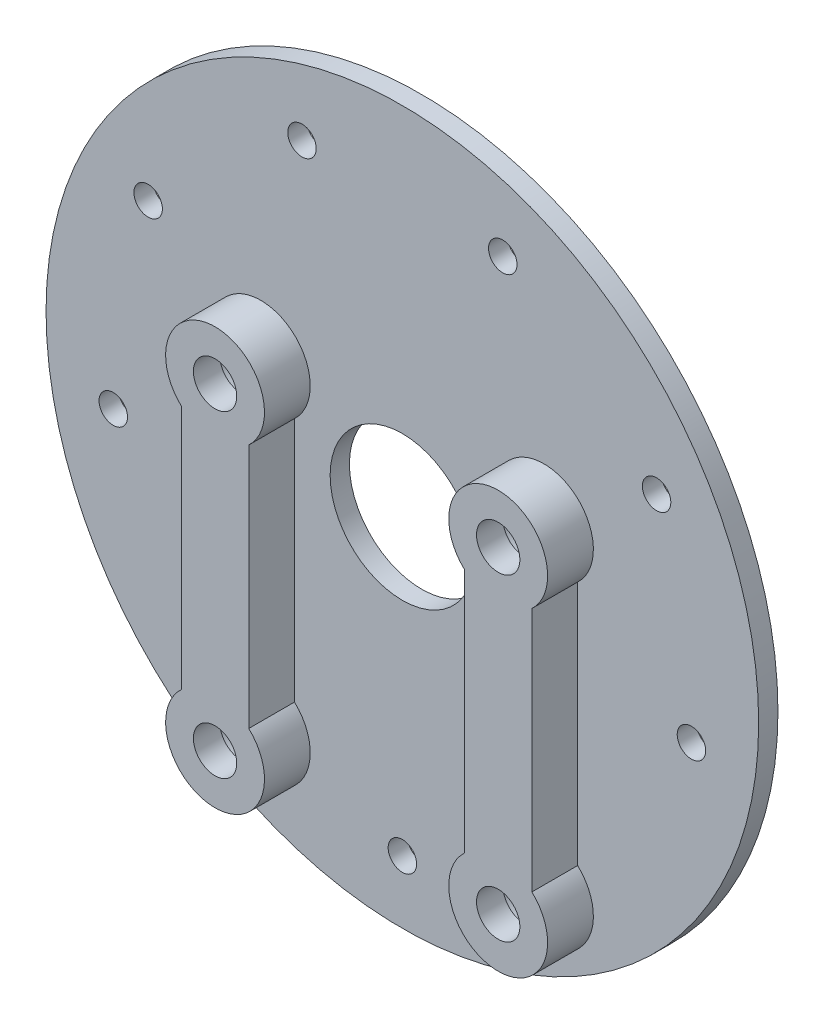
ISO-10303-21;
HEADER;
FILE_DESCRIPTION(('STEP AP214'),'2;1');
FILE_NAME('part.step','',(''),(''),'','','');
FILE_SCHEMA(('AUTOMOTIVE_DESIGN { 1 0 10303 214 1 1 1 1 }'));
ENDSEC;
DATA;
#1=APPLICATION_CONTEXT('core data for automotive mechanical design processes');
#2=APPLICATION_PROTOCOL_DEFINITION('international standard','automotive_design',2000,#1);
#3=PRODUCT_CONTEXT('',#1,'mechanical');
#4=PRODUCT('Part','Part','',(#3));
#5=PRODUCT_RELATED_PRODUCT_CATEGORY('part','',(#4));
#6=PRODUCT_DEFINITION_FORMATION('','',#4);
#7=PRODUCT_DEFINITION_CONTEXT('part definition',#1,'design');
#8=PRODUCT_DEFINITION('design','',#6,#7);
#9=PRODUCT_DEFINITION_SHAPE('','',#8);
#10=(LENGTH_UNIT() NAMED_UNIT(*) SI_UNIT(.MILLI.,.METRE.));
#11=(NAMED_UNIT(*) PLANE_ANGLE_UNIT() SI_UNIT($,.RADIAN.));
#12=(NAMED_UNIT(*) SI_UNIT($,.STERADIAN.) SOLID_ANGLE_UNIT());
#13=UNCERTAINTY_MEASURE_WITH_UNIT(LENGTH_MEASURE(1.E-05),#10,'distance_accuracy_value','');
#14=(GEOMETRIC_REPRESENTATION_CONTEXT(3) GLOBAL_UNCERTAINTY_ASSIGNED_CONTEXT((#13)) GLOBAL_UNIT_ASSIGNED_CONTEXT((#10,
#11,#12)) REPRESENTATION_CONTEXT('',''));
#15=CARTESIAN_POINT('',(0.,0.,0.));
#16=DIRECTION('',(0.,0.,1.));
#17=DIRECTION('',(1.,0.,0.));
#18=AXIS2_PLACEMENT_3D('',#15,#16,#17);
#19=CARTESIAN_POINT('',(0.,0.,2.));
#20=DIRECTION('',(0.,0.,1.));
#21=DIRECTION('',(1.,0.,0.));
#22=AXIS2_PLACEMENT_3D('',#19,#20,#21);
#23=PLANE('',#22);
#24=CARTESIAN_POINT('',(0.,0.,2.));
#25=DIRECTION('',(0.,0.,1.));
#26=DIRECTION('',(1.,0.,0.));
#27=AXIS2_PLACEMENT_3D('',#24,#25,#26);
#28=CIRCLE('',#27,7.49999999999999);
#29=CARTESIAN_POINT('',(7.49999999999999,0.,2.));
#30=VERTEX_POINT('',#29);
#31=EDGE_CURVE('E344',#30,#30,#28,.T.);
#32=ORIENTED_EDGE('',*,*,#31,.F.);
#33=EDGE_LOOP('',(#32));
#34=FACE_BOUND('',#33,.T.);
#35=CARTESIAN_POINT('',(-30.0169403118121,-5.29279645528783,2.));
#36=DIRECTION('',(0.,0.,1.));
#37=DIRECTION('',(1.,0.,0.));
#38=AXIS2_PLACEMENT_3D('',#35,#36,#37);
#39=CIRCLE('',#38,1.47828000000002);
#40=CARTESIAN_POINT('',(-28.5386603118121,-5.29279645528783,2.));
#41=VERTEX_POINT('',#40);
#42=EDGE_CURVE('E347',#41,#41,#39,.T.);
#43=ORIENTED_EDGE('',*,*,#42,.F.);
#44=EDGE_LOOP('',(#43));
#45=FACE_BOUND('',#44,.T.);
#46=CARTESIAN_POINT('',(-26.3964543073496,15.2400000000002,2.));
#47=DIRECTION('',(0.,0.,1.));
#48=DIRECTION('',(1.,0.,0.));
#49=AXIS2_PLACEMENT_3D('',#46,#47,#48);
#50=CIRCLE('',#49,1.47828000000002);
#51=CARTESIAN_POINT('',(-24.9181743073496,15.2400000000002,2.));
#52=VERTEX_POINT('',#51);
#53=EDGE_CURVE('E353',#52,#52,#50,.T.);
#54=ORIENTED_EDGE('',*,*,#53,.F.);
#55=EDGE_LOOP('',(#54));
#56=FACE_BOUND('',#55,.T.);
#57=CARTESIAN_POINT('',(-10.4247739685661,28.6418310815546,2.));
#58=DIRECTION('',(0.,0.,1.));
#59=DIRECTION('',(1.,0.,0.));
#60=AXIS2_PLACEMENT_3D('',#57,#58,#59);
#61=CIRCLE('',#60,1.47828000000002);
#62=CARTESIAN_POINT('',(-8.94649396856608,28.6418310815546,2.));
#63=VERTEX_POINT('',#62);
#64=EDGE_CURVE('E359',#63,#63,#61,.T.);
#65=ORIENTED_EDGE('',*,*,#64,.F.);
#66=EDGE_LOOP('',(#65));
#67=FACE_BOUND('',#66,.T.);
#68=CARTESIAN_POINT('',(10.4247739685667,28.6418310815544,2.));
#69=DIRECTION('',(0.,0.,1.));
#70=DIRECTION('',(1.,0.,0.));
#71=AXIS2_PLACEMENT_3D('',#68,#69,#70);
#72=CIRCLE('',#71,1.47828000000002);
#73=CARTESIAN_POINT('',(11.9030539685667,28.6418310815544,2.));
#74=VERTEX_POINT('',#73);
#75=EDGE_CURVE('E365',#74,#74,#72,.T.);
#76=ORIENTED_EDGE('',*,*,#75,.F.);
#77=EDGE_LOOP('',(#76));
#78=FACE_BOUND('',#77,.T.);
#79=CARTESIAN_POINT('',(26.3964543073499,15.2399999999997,2.));
#80=DIRECTION('',(0.,0.,1.));
#81=DIRECTION('',(1.,0.,0.));
#82=AXIS2_PLACEMENT_3D('',#79,#80,#81);
#83=CIRCLE('',#82,1.47828000000002);
#84=CARTESIAN_POINT('',(27.8747343073499,15.2399999999997,2.));
#85=VERTEX_POINT('',#84);
#86=EDGE_CURVE('E371',#85,#85,#83,.T.);
#87=ORIENTED_EDGE('',*,*,#86,.F.);
#88=EDGE_LOOP('',(#87));
#89=FACE_BOUND('',#88,.T.);
#90=CARTESIAN_POINT('',(30.016940311812,-5.29279645528849,2.));
#91=DIRECTION('',(0.,0.,1.));
#92=DIRECTION('',(1.,0.,0.));
#93=AXIS2_PLACEMENT_3D('',#90,#91,#92);
#94=CIRCLE('',#93,1.47828000000002);
#95=CARTESIAN_POINT('',(31.495220311812,-5.29279645528849,2.));
#96=VERTEX_POINT('',#95);
#97=EDGE_CURVE('E377',#96,#96,#94,.T.);
#98=ORIENTED_EDGE('',*,*,#97,.F.);
#99=EDGE_LOOP('',(#98));
#100=FACE_BOUND('',#99,.T.);
#101=CARTESIAN_POINT('',(0.,-30.48,2.));
#102=DIRECTION('',(0.,0.,1.));
#103=DIRECTION('',(1.,0.,0.));
#104=AXIS2_PLACEMENT_3D('',#101,#102,#103);
#105=CIRCLE('',#104,1.47828000000002);
#106=CARTESIAN_POINT('',(1.47828000000002,-30.48,2.));
#107=VERTEX_POINT('',#106);
#108=EDGE_CURVE('E383',#107,#107,#105,.T.);
#109=ORIENTED_EDGE('',*,*,#108,.F.);
#110=EDGE_LOOP('',(#109));
#111=FACE_BOUND('',#110,.T.);
#112=DIRECTION('',(0.,1.,0.));
#113=VECTOR('',#112,1.);
#114=CARTESIAN_POINT('',(-11.2000000001251,3.24641800820938,2.));
#115=LINE('',#114,#113);
#116=CARTESIAN_POINT('',(-11.2000000001251,-22.246481648177,2.));
#117=VERTEX_POINT('',#116);
#118=CARTESIAN_POINT('',(-11.2000000001251,3.24641800820938,2.));
#119=VERTEX_POINT('',#118);
#120=EDGE_CURVE('E126',#117,#119,#115,.T.);
#121=ORIENTED_EDGE('',*,*,#120,.F.);
#122=CARTESIAN_POINT('',(-14.7000000001501,-26.0000212132181,2.));
#123=DIRECTION('',(0.,0.,1.));
#124=DIRECTION('',(-1.,0.,0.));
#125=AXIS2_PLACEMENT_3D('',#122,#123,#124);
#126=CIRCLE('',#125,5.1321593181139);
#127=CARTESIAN_POINT('',(-18.1999999999444,-22.2464816479619,2.));
#128=VERTEX_POINT('',#127);
#129=EDGE_CURVE('E123',#128,#117,#126,.T.);
#130=ORIENTED_EDGE('',*,*,#129,.F.);
#131=DIRECTION('',(0.,-1.,0.));
#132=VECTOR('',#131,1.);
#133=CARTESIAN_POINT('',(-18.1999999999444,-22.2464816479619,2.));
#134=LINE('',#133,#132);
#135=CARTESIAN_POINT('',(-18.1999999999444,3.24641800823799,2.));
#136=VERTEX_POINT('',#135);
#137=EDGE_CURVE('E135',#136,#128,#134,.T.);
#138=ORIENTED_EDGE('',*,*,#137,.F.);
#139=CARTESIAN_POINT('',(-14.7000000000194,6.99995757357735,2.));
#140=DIRECTION('',(0.,0.,1.));
#141=DIRECTION('',(-1.,0.,0.));
#142=AXIS2_PLACEMENT_3D('',#139,#140,#141);
#143=CIRCLE('',#142,5.13215931826389);
#144=EDGE_CURVE('E143',#119,#136,#143,.T.);
#145=ORIENTED_EDGE('',*,*,#144,.F.);
#146=EDGE_LOOP('',(#121,#130,#138,#145));
#147=FACE_BOUND('',#146,.T.);
#148=CARTESIAN_POINT('',(0.,0.,2.));
#149=DIRECTION('',(0.,0.,1.));
#150=DIRECTION('',(1.,0.,0.));
#151=AXIS2_PLACEMENT_3D('',#148,#149,#150);
#152=CIRCLE('',#151,37.);
#153=CARTESIAN_POINT('',(37.,0.,2.));
#154=VERTEX_POINT('',#153);
#155=EDGE_CURVE('E40',#154,#154,#152,.T.);
#156=ORIENTED_EDGE('',*,*,#155,.T.);
#157=EDGE_LOOP('',(#156));
#158=FACE_BOUND('',#157,.T.);
#159=DIRECTION('',(0.,-1.,0.));
#160=VECTOR('',#159,1.);
#161=CARTESIAN_POINT('',(11.2000000000556,-22.2464816477019,2.));
#162=LINE('',#161,#160);
#163=CARTESIAN_POINT('',(11.2000000000556,3.24641800838311,2.));
#164=VERTEX_POINT('',#163);
#165=CARTESIAN_POINT('',(11.2000000000556,-22.2464816477019,2.));
#166=VERTEX_POINT('',#165);
#167=EDGE_CURVE('E393',#164,#166,#162,.T.);
#168=ORIENTED_EDGE('',*,*,#167,.F.);
#169=CARTESIAN_POINT('',(14.6999999999806,6.99995757360497,2.));
#170=DIRECTION('',(0.,0.,1.));
#171=DIRECTION('',(-1.,0.,0.));
#172=AXIS2_PLACEMENT_3D('',#169,#170,#171);
#173=CIRCLE('',#172,5.13215931817796);
#174=CARTESIAN_POINT('',(18.1999999998749,3.2464180083545,2.));
#175=VERTEX_POINT('',#174);
#176=EDGE_CURVE('E121',#175,#164,#173,.T.);
#177=ORIENTED_EDGE('',*,*,#176,.F.);
#178=DIRECTION('',(0.,1.,0.));
#179=VECTOR('',#178,1.);
#180=CARTESIAN_POINT('',(18.1999999998749,3.2464180083545,2.));
#181=LINE('',#180,#179);
#182=CARTESIAN_POINT('',(18.1999999998749,-22.246481647917,2.));
#183=VERTEX_POINT('',#182);
#184=EDGE_CURVE('E117',#183,#175,#181,.T.);
#185=ORIENTED_EDGE('',*,*,#184,.F.);
#186=CARTESIAN_POINT('',(14.6999999998499,-26.0000212131908,2.));
#187=DIRECTION('',(0.,0.,1.));
#188=DIRECTION('',(-1.,0.,0.));
#189=AXIS2_PLACEMENT_3D('',#186,#187,#188);
#190=CIRCLE('',#189,5.13215931828412);
#191=EDGE_CURVE('E395',#166,#183,#190,.T.);
#192=ORIENTED_EDGE('',*,*,#191,.F.);
#193=EDGE_LOOP('',(#168,#177,#185,#192));
#194=FACE_BOUND('',#193,.T.);
#195=ADVANCED_FACE('F32',(#34,#45,#56,#67,#78,#89,#100,#111,#147,#158,#194),#23,.T.);
#196=CARTESIAN_POINT('',(0.,0.,0.));
#197=DIRECTION('',(0.,0.,1.));
#198=DIRECTION('',(1.,0.,0.));
#199=AXIS2_PLACEMENT_3D('',#196,#197,#198);
#200=CYLINDRICAL_SURFACE('',#199,37.);
#201=CARTESIAN_POINT('',(0.,0.,0.));
#202=DIRECTION('',(0.,0.,1.));
#203=DIRECTION('',(1.,0.,0.));
#204=AXIS2_PLACEMENT_3D('',#201,#202,#203);
#205=CIRCLE('',#204,37.);
#206=CARTESIAN_POINT('',(37.,0.,0.));
#207=VERTEX_POINT('',#206);
#208=EDGE_CURVE('E11',#207,#207,#205,.T.);
#209=ORIENTED_EDGE('',*,*,#208,.T.);
#210=EDGE_LOOP('',(#209));
#211=FACE_BOUND('',#210,.T.);
#212=ORIENTED_EDGE('',*,*,#155,.F.);
#213=EDGE_LOOP('',(#212));
#214=FACE_BOUND('',#213,.T.);
#215=ADVANCED_FACE('F34',(#211,#214),#200,.T.);
#216=CARTESIAN_POINT('',(37.,0.,0.));
#217=DIRECTION('',(0.,0.,-1.));
#218=DIRECTION('',(-1.,0.,0.));
#219=AXIS2_PLACEMENT_3D('',#216,#217,#218);
#220=PLANE('',#219);
#221=CARTESIAN_POINT('',(-14.7000000000501,-26.0000000000137,0.));
#222=DIRECTION('',(0.,0.,-1.));
#223=DIRECTION('',(-1.,0.,0.));
#224=AXIS2_PLACEMENT_3D('',#221,#222,#223);
#225=CIRCLE('',#224,3.5);
#226=CARTESIAN_POINT('',(-18.2000000000501,-26.0000000000137,0.));
#227=VERTEX_POINT('',#226);
#228=EDGE_CURVE('E295',#227,#227,#225,.T.);
#229=ORIENTED_EDGE('',*,*,#228,.F.);
#230=EDGE_LOOP('',(#229));
#231=FACE_BOUND('',#230,.T.);
#232=CARTESIAN_POINT('',(14.6999999999999,6.999957573605,0.));
#233=DIRECTION('',(0.,0.,-1.));
#234=DIRECTION('',(-1.,0.,0.));
#235=AXIS2_PLACEMENT_3D('',#232,#233,#234);
#236=CIRCLE('',#235,3.5);
#237=CARTESIAN_POINT('',(11.1999999999999,6.999957573605,0.));
#238=VERTEX_POINT('',#237);
#239=EDGE_CURVE('E305',#238,#238,#236,.T.);
#240=ORIENTED_EDGE('',*,*,#239,.F.);
#241=EDGE_LOOP('',(#240));
#242=FACE_BOUND('',#241,.T.);
#243=CARTESIAN_POINT('',(14.6999999999499,-25.9999999999864,0.));
#244=DIRECTION('',(0.,0.,-1.));
#245=DIRECTION('',(-1.,0.,0.));
#246=AXIS2_PLACEMENT_3D('',#243,#244,#245);
#247=CIRCLE('',#246,3.5);
#248=CARTESIAN_POINT('',(11.1999999999499,-25.9999999999864,0.));
#249=VERTEX_POINT('',#248);
#250=EDGE_CURVE('E317',#249,#249,#247,.T.);
#251=ORIENTED_EDGE('',*,*,#250,.F.);
#252=EDGE_LOOP('',(#251));
#253=FACE_BOUND('',#252,.T.);
#254=CARTESIAN_POINT('',(-14.7000000000001,6.99995757357738,0.));
#255=DIRECTION('',(0.,0.,-1.));
#256=DIRECTION('',(-1.,0.,0.));
#257=AXIS2_PLACEMENT_3D('',#254,#255,#256);
#258=CIRCLE('',#257,3.5);
#259=CARTESIAN_POINT('',(-18.2000000000001,6.99995757357738,0.));
#260=VERTEX_POINT('',#259);
#261=EDGE_CURVE('E329',#260,#260,#258,.T.);
#262=ORIENTED_EDGE('',*,*,#261,.F.);
#263=EDGE_LOOP('',(#262));
#264=FACE_BOUND('',#263,.T.);
#265=CARTESIAN_POINT('',(0.,0.,0.));
#266=DIRECTION('',(0.,0.,-1.));
#267=DIRECTION('',(-1.,0.,0.));
#268=AXIS2_PLACEMENT_3D('',#265,#266,#267);
#269=CIRCLE('',#268,7.49999999999999);
#270=CARTESIAN_POINT('',(-7.49999999999999,0.,0.));
#271=VERTEX_POINT('',#270);
#272=EDGE_CURVE('E341',#271,#271,#269,.T.);
#273=ORIENTED_EDGE('',*,*,#272,.F.);
#274=EDGE_LOOP('',(#273));
#275=FACE_BOUND('',#274,.T.);
#276=CARTESIAN_POINT('',(-30.0169403118121,-5.29279645528783,0.));
#277=DIRECTION('',(0.,0.,1.));
#278=DIRECTION('',(1.,0.,0.));
#279=AXIS2_PLACEMENT_3D('',#276,#277,#278);
#280=CIRCLE('',#279,1.47828000000002);
#281=CARTESIAN_POINT('',(-28.5386603118121,-5.29279645528783,0.));
#282=VERTEX_POINT('',#281);
#283=EDGE_CURVE('E350',#282,#282,#280,.T.);
#284=ORIENTED_EDGE('',*,*,#283,.T.);
#285=EDGE_LOOP('',(#284));
#286=FACE_BOUND('',#285,.T.);
#287=CARTESIAN_POINT('',(-26.3964543073496,15.2400000000002,0.));
#288=DIRECTION('',(0.,0.,1.));
#289=DIRECTION('',(1.,0.,0.));
#290=AXIS2_PLACEMENT_3D('',#287,#288,#289);
#291=CIRCLE('',#290,1.47828000000002);
#292=CARTESIAN_POINT('',(-24.9181743073496,15.2400000000002,0.));
#293=VERTEX_POINT('',#292);
#294=EDGE_CURVE('E356',#293,#293,#291,.T.);
#295=ORIENTED_EDGE('',*,*,#294,.T.);
#296=EDGE_LOOP('',(#295));
#297=FACE_BOUND('',#296,.T.);
#298=CARTESIAN_POINT('',(-10.4247739685661,28.6418310815546,0.));
#299=DIRECTION('',(0.,0.,1.));
#300=DIRECTION('',(1.,0.,0.));
#301=AXIS2_PLACEMENT_3D('',#298,#299,#300);
#302=CIRCLE('',#301,1.47828000000002);
#303=CARTESIAN_POINT('',(-8.94649396856608,28.6418310815546,0.));
#304=VERTEX_POINT('',#303);
#305=EDGE_CURVE('E362',#304,#304,#302,.T.);
#306=ORIENTED_EDGE('',*,*,#305,.T.);
#307=EDGE_LOOP('',(#306));
#308=FACE_BOUND('',#307,.T.);
#309=CARTESIAN_POINT('',(10.4247739685667,28.6418310815544,0.));
#310=DIRECTION('',(0.,0.,1.));
#311=DIRECTION('',(1.,0.,0.));
#312=AXIS2_PLACEMENT_3D('',#309,#310,#311);
#313=CIRCLE('',#312,1.47828000000002);
#314=CARTESIAN_POINT('',(11.9030539685667,28.6418310815544,0.));
#315=VERTEX_POINT('',#314);
#316=EDGE_CURVE('E368',#315,#315,#313,.T.);
#317=ORIENTED_EDGE('',*,*,#316,.T.);
#318=EDGE_LOOP('',(#317));
#319=FACE_BOUND('',#318,.T.);
#320=CARTESIAN_POINT('',(26.3964543073499,15.2399999999997,0.));
#321=DIRECTION('',(0.,0.,1.));
#322=DIRECTION('',(1.,0.,0.));
#323=AXIS2_PLACEMENT_3D('',#320,#321,#322);
#324=CIRCLE('',#323,1.47828000000002);
#325=CARTESIAN_POINT('',(27.8747343073499,15.2399999999997,0.));
#326=VERTEX_POINT('',#325);
#327=EDGE_CURVE('E374',#326,#326,#324,.T.);
#328=ORIENTED_EDGE('',*,*,#327,.T.);
#329=EDGE_LOOP('',(#328));
#330=FACE_BOUND('',#329,.T.);
#331=CARTESIAN_POINT('',(30.016940311812,-5.29279645528849,0.));
#332=DIRECTION('',(0.,0.,1.));
#333=DIRECTION('',(1.,0.,0.));
#334=AXIS2_PLACEMENT_3D('',#331,#332,#333);
#335=CIRCLE('',#334,1.47828000000001);
#336=CARTESIAN_POINT('',(31.495220311812,-5.29279645528849,0.));
#337=VERTEX_POINT('',#336);
#338=EDGE_CURVE('E380',#337,#337,#335,.T.);
#339=ORIENTED_EDGE('',*,*,#338,.T.);
#340=EDGE_LOOP('',(#339));
#341=FACE_BOUND('',#340,.T.);
#342=CARTESIAN_POINT('',(0.,-30.48,0.));
#343=DIRECTION('',(0.,0.,1.));
#344=DIRECTION('',(1.,0.,0.));
#345=AXIS2_PLACEMENT_3D('',#342,#343,#344);
#346=CIRCLE('',#345,1.47828000000002);
#347=CARTESIAN_POINT('',(1.47828000000002,-30.48,0.));
#348=VERTEX_POINT('',#347);
#349=EDGE_CURVE('E386',#348,#348,#346,.T.);
#350=ORIENTED_EDGE('',*,*,#349,.T.);
#351=EDGE_LOOP('',(#350));
#352=FACE_BOUND('',#351,.T.);
#353=ORIENTED_EDGE('',*,*,#208,.F.);
#354=EDGE_LOOP('',(#353));
#355=FACE_BOUND('',#354,.T.);
#356=ADVANCED_FACE('F159',(#231,#242,#253,#264,#275,#286,#297,#308,#319,#330,#341,#352,#355),
#220,.T.);
#357=CARTESIAN_POINT('',(-14.7000000001501,-26.0000212132181,6.74999999999998));
#358=DIRECTION('',(0.,0.,-1.));
#359=DIRECTION('',(-1.,0.,0.));
#360=AXIS2_PLACEMENT_3D('',#357,#358,#359);
#361=CYLINDRICAL_SURFACE('',#360,5.1321593181139);
#362=ORIENTED_EDGE('',*,*,#129,.T.);
#363=DIRECTION('',(0.,0.,-1.));
#364=VECTOR('',#363,1.);
#365=CARTESIAN_POINT('',(-11.2000000001251,-22.246481648177,6.74999999999998));
#366=LINE('',#365,#364);
#367=CARTESIAN_POINT('',(-11.2000000001251,-22.246481648177,6.74999999999998));
#368=VERTEX_POINT('',#367);
#369=EDGE_CURVE('E152',#368,#117,#366,.T.);
#370=ORIENTED_EDGE('',*,*,#369,.F.);
#371=CARTESIAN_POINT('',(-14.7000000001501,-26.0000212132181,6.74999999999998));
#372=DIRECTION('',(0.,0.,1.));
#373=DIRECTION('',(-1.,0.,0.));
#374=AXIS2_PLACEMENT_3D('',#371,#372,#373);
#375=CIRCLE('',#374,5.1321593181139);
#376=CARTESIAN_POINT('',(-18.1999999999444,-22.2464816479619,6.74999999999998));
#377=VERTEX_POINT('',#376);
#378=EDGE_CURVE('E131',#377,#368,#375,.T.);
#379=ORIENTED_EDGE('',*,*,#378,.F.);
#380=DIRECTION('',(0.,0.,-1.));
#381=VECTOR('',#380,1.);
#382=CARTESIAN_POINT('',(-18.1999999999444,-22.2464816479619,6.74999999999998));
#383=LINE('',#382,#381);
#384=EDGE_CURVE('E140',#377,#128,#383,.T.);
#385=ORIENTED_EDGE('',*,*,#384,.T.);
#386=EDGE_LOOP('',(#362,#370,#379,#385));
#387=FACE_BOUND('',#386,.T.);
#388=ADVANCED_FACE('F165',(#387),#361,.T.);
#389=CARTESIAN_POINT('',(-11.2000000001251,3.24641800820938,6.74999999999998));
#390=DIRECTION('',(-1.,0.,0.));
#391=DIRECTION('',(0.,-1.,0.));
#392=AXIS2_PLACEMENT_3D('',#389,#390,#391);
#393=PLANE('',#392);
#394=ORIENTED_EDGE('',*,*,#120,.T.);
#395=DIRECTION('',(0.,0.,-1.));
#396=VECTOR('',#395,1.);
#397=CARTESIAN_POINT('',(-11.2000000001251,3.24641800820938,6.74999999999998));
#398=LINE('',#397,#396);
#399=CARTESIAN_POINT('',(-11.2000000001251,3.24641800820938,6.74999999999998));
#400=VERTEX_POINT('',#399);
#401=EDGE_CURVE('E149',#400,#119,#398,.T.);
#402=ORIENTED_EDGE('',*,*,#401,.F.);
#403=DIRECTION('',(0.,1.,0.));
#404=VECTOR('',#403,1.);
#405=CARTESIAN_POINT('',(-11.2000000001251,3.24641800820938,6.74999999999998));
#406=LINE('',#405,#404);
#407=EDGE_CURVE('E134',#368,#400,#406,.T.);
#408=ORIENTED_EDGE('',*,*,#407,.F.);
#409=ORIENTED_EDGE('',*,*,#369,.T.);
#410=EDGE_LOOP('',(#394,#402,#408,#409));
#411=FACE_BOUND('',#410,.T.);
#412=ADVANCED_FACE('F178',(#411),#393,.F.);
#413=CARTESIAN_POINT('',(-14.7000000000194,6.99995757357735,6.74999999999998));
#414=DIRECTION('',(0.,0.,-1.));
#415=DIRECTION('',(-1.,0.,0.));
#416=AXIS2_PLACEMENT_3D('',#413,#414,#415);
#417=CYLINDRICAL_SURFACE('',#416,5.13215931826389);
#418=ORIENTED_EDGE('',*,*,#144,.T.);
#419=DIRECTION('',(0.,0.,-1.));
#420=VECTOR('',#419,1.);
#421=CARTESIAN_POINT('',(-18.1999999999444,3.24641800823799,6.74999999999998));
#422=LINE('',#421,#420);
#423=CARTESIAN_POINT('',(-18.1999999999444,3.24641800823799,6.74999999999998));
#424=VERTEX_POINT('',#423);
#425=EDGE_CURVE('E55',#424,#136,#422,.T.);
#426=ORIENTED_EDGE('',*,*,#425,.F.);
#427=CARTESIAN_POINT('',(-14.7000000000194,6.99995757357735,6.74999999999998));
#428=DIRECTION('',(0.,0.,1.));
#429=DIRECTION('',(-1.,0.,0.));
#430=AXIS2_PLACEMENT_3D('',#427,#428,#429);
#431=CIRCLE('',#430,5.13215931826389);
#432=EDGE_CURVE('E137',#400,#424,#431,.T.);
#433=ORIENTED_EDGE('',*,*,#432,.F.);
#434=ORIENTED_EDGE('',*,*,#401,.T.);
#435=EDGE_LOOP('',(#418,#426,#433,#434));
#436=FACE_BOUND('',#435,.T.);
#437=ADVANCED_FACE('F182',(#436),#417,.T.);
#438=CARTESIAN_POINT('',(-18.1999999999444,-22.2464816479619,6.74999999999998));
#439=DIRECTION('',(1.,0.,0.));
#440=DIRECTION('',(0.,0.,-1.));
#441=AXIS2_PLACEMENT_3D('',#438,#439,#440);
#442=PLANE('',#441);
#443=ORIENTED_EDGE('',*,*,#137,.T.);
#444=ORIENTED_EDGE('',*,*,#384,.F.);
#445=DIRECTION('',(0.,-1.,0.));
#446=VECTOR('',#445,1.);
#447=CARTESIAN_POINT('',(-18.1999999999444,-22.2464816479619,6.74999999999998));
#448=LINE('',#447,#446);
#449=EDGE_CURVE('E139',#424,#377,#448,.T.);
#450=ORIENTED_EDGE('',*,*,#449,.F.);
#451=ORIENTED_EDGE('',*,*,#425,.T.);
#452=EDGE_LOOP('',(#443,#444,#450,#451));
#453=FACE_BOUND('',#452,.T.);
#454=ADVANCED_FACE('F186',(#453),#442,.F.);
#455=CARTESIAN_POINT('',(-14.7000000001501,-26.0000212132181,6.74999999999998));
#456=DIRECTION('',(0.,0.,-1.));
#457=DIRECTION('',(-1.,0.,0.));
#458=AXIS2_PLACEMENT_3D('',#455,#456,#457);
#459=PLANE('',#458);
#460=CARTESIAN_POINT('',(-14.7000000000501,-26.0000000000137,6.74999999999998));
#461=DIRECTION('',(0.,0.,-1.));
#462=DIRECTION('',(-1.,0.,0.));
#463=AXIS2_PLACEMENT_3D('',#460,#461,#462);
#464=CIRCLE('',#463,2.24999999999999);
#465=CARTESIAN_POINT('',(-16.9500000000501,-26.0000000000137,6.74999999999998));
#466=VERTEX_POINT('',#465);
#467=EDGE_CURVE('E302',#466,#466,#464,.T.);
#468=ORIENTED_EDGE('',*,*,#467,.T.);
#469=EDGE_LOOP('',(#468));
#470=FACE_BOUND('',#469,.T.);
#471=CARTESIAN_POINT('',(-14.7000000000001,6.99995757357738,6.74999999999998));
#472=DIRECTION('',(0.,0.,-1.));
#473=DIRECTION('',(-1.,0.,0.));
#474=AXIS2_PLACEMENT_3D('',#471,#472,#473);
#475=CIRCLE('',#474,2.24999999999999);
#476=CARTESIAN_POINT('',(-16.9500000000001,6.99995757357738,6.74999999999998));
#477=VERTEX_POINT('',#476);
#478=EDGE_CURVE('E338',#477,#477,#475,.T.);
#479=ORIENTED_EDGE('',*,*,#478,.T.);
#480=EDGE_LOOP('',(#479));
#481=FACE_BOUND('',#480,.T.);
#482=ORIENTED_EDGE('',*,*,#378,.T.);
#483=ORIENTED_EDGE('',*,*,#407,.T.);
#484=ORIENTED_EDGE('',*,*,#432,.T.);
#485=ORIENTED_EDGE('',*,*,#449,.T.);
#486=EDGE_LOOP('',(#482,#483,#484,#485));
#487=FACE_BOUND('',#486,.T.);
#488=ADVANCED_FACE('F190',(#470,#481,#487),#459,.F.);
#489=CARTESIAN_POINT('',(14.6999999999806,6.99995757360497,6.74999999999998));
#490=DIRECTION('',(0.,0.,-1.));
#491=DIRECTION('',(-1.,0.,0.));
#492=AXIS2_PLACEMENT_3D('',#489,#490,#491);
#493=CYLINDRICAL_SURFACE('',#492,5.13215931817796);
#494=ORIENTED_EDGE('',*,*,#176,.T.);
#495=DIRECTION('',(0.,0.,-1.));
#496=VECTOR('',#495,1.);
#497=CARTESIAN_POINT('',(11.2000000000556,3.24641800838311,6.74999999999998));
#498=LINE('',#497,#496);
#499=CARTESIAN_POINT('',(11.2000000000556,3.24641800838311,6.74999999999998));
#500=VERTEX_POINT('',#499);
#501=EDGE_CURVE('E102',#500,#164,#498,.T.);
#502=ORIENTED_EDGE('',*,*,#501,.F.);
#503=CARTESIAN_POINT('',(14.6999999999806,6.99995757360497,6.74999999999998));
#504=DIRECTION('',(0.,0.,1.));
#505=DIRECTION('',(-1.,0.,0.));
#506=AXIS2_PLACEMENT_3D('',#503,#504,#505);
#507=CIRCLE('',#506,5.13215931817796);
#508=CARTESIAN_POINT('',(18.1999999998749,3.2464180083545,6.74999999999998));
#509=VERTEX_POINT('',#508);
#510=EDGE_CURVE('E109',#509,#500,#507,.T.);
#511=ORIENTED_EDGE('',*,*,#510,.F.);
#512=DIRECTION('',(0.,0.,-1.));
#513=VECTOR('',#512,1.);
#514=CARTESIAN_POINT('',(18.1999999998749,3.2464180083545,6.74999999999998));
#515=LINE('',#514,#513);
#516=EDGE_CURVE('E391',#509,#175,#515,.T.);
#517=ORIENTED_EDGE('',*,*,#516,.T.);
#518=EDGE_LOOP('',(#494,#502,#511,#517));
#519=FACE_BOUND('',#518,.T.);
#520=ADVANCED_FACE('F119',(#519),#493,.T.);
#521=CARTESIAN_POINT('',(11.2000000000556,-22.2464816477019,6.74999999999998));
#522=DIRECTION('',(1.,0.,0.));
#523=DIRECTION('',(0.,0.,-1.));
#524=AXIS2_PLACEMENT_3D('',#521,#522,#523);
#525=PLANE('',#524);
#526=ORIENTED_EDGE('',*,*,#167,.T.);
#527=DIRECTION('',(0.,0.,-1.));
#528=VECTOR('',#527,1.);
#529=CARTESIAN_POINT('',(11.2000000000556,-22.2464816477019,6.74999999999998));
#530=LINE('',#529,#528);
#531=CARTESIAN_POINT('',(11.2000000000556,-22.2464816477019,6.74999999999998));
#532=VERTEX_POINT('',#531);
#533=EDGE_CURVE('E105',#532,#166,#530,.T.);
#534=ORIENTED_EDGE('',*,*,#533,.F.);
#535=DIRECTION('',(0.,-1.,0.));
#536=VECTOR('',#535,1.);
#537=CARTESIAN_POINT('',(11.2000000000556,-22.2464816477019,6.74999999999998));
#538=LINE('',#537,#536);
#539=EDGE_CURVE('E98',#500,#532,#538,.T.);
#540=ORIENTED_EDGE('',*,*,#539,.F.);
#541=ORIENTED_EDGE('',*,*,#501,.T.);
#542=EDGE_LOOP('',(#526,#534,#540,#541));
#543=FACE_BOUND('',#542,.T.);
#544=ADVANCED_FACE('F100',(#543),#525,.F.);
#545=CARTESIAN_POINT('',(14.6999999998499,-26.0000212131908,6.74999999999998));
#546=DIRECTION('',(0.,0.,-1.));
#547=DIRECTION('',(-1.,0.,0.));
#548=AXIS2_PLACEMENT_3D('',#545,#546,#547);
#549=CYLINDRICAL_SURFACE('',#548,5.13215931828412);
#550=ORIENTED_EDGE('',*,*,#191,.T.);
#551=DIRECTION('',(0.,0.,-1.));
#552=VECTOR('',#551,1.);
#553=CARTESIAN_POINT('',(18.1999999998749,-22.246481647917,6.74999999999998));
#554=LINE('',#553,#552);
#555=CARTESIAN_POINT('',(18.1999999998749,-22.246481647917,6.74999999999998));
#556=VERTEX_POINT('',#555);
#557=EDGE_CURVE('E47',#556,#183,#554,.T.);
#558=ORIENTED_EDGE('',*,*,#557,.F.);
#559=CARTESIAN_POINT('',(14.6999999998499,-26.0000212131908,6.74999999999998));
#560=DIRECTION('',(0.,0.,1.));
#561=DIRECTION('',(-1.,0.,0.));
#562=AXIS2_PLACEMENT_3D('',#559,#560,#561);
#563=CIRCLE('',#562,5.13215931828412);
#564=EDGE_CURVE('E108',#532,#556,#563,.T.);
#565=ORIENTED_EDGE('',*,*,#564,.F.);
#566=ORIENTED_EDGE('',*,*,#533,.T.);
#567=EDGE_LOOP('',(#550,#558,#565,#566));
#568=FACE_BOUND('',#567,.T.);
#569=ADVANCED_FACE('F198',(#568),#549,.T.);
#570=CARTESIAN_POINT('',(18.1999999998749,3.2464180083545,6.74999999999998));
#571=DIRECTION('',(-1.,0.,0.));
#572=DIRECTION('',(0.,-1.,0.));
#573=AXIS2_PLACEMENT_3D('',#570,#571,#572);
#574=PLANE('',#573);
#575=ORIENTED_EDGE('',*,*,#184,.T.);
#576=ORIENTED_EDGE('',*,*,#516,.F.);
#577=DIRECTION('',(0.,1.,0.));
#578=VECTOR('',#577,1.);
#579=CARTESIAN_POINT('',(18.1999999998749,3.2464180083545,6.74999999999998));
#580=LINE('',#579,#578);
#581=EDGE_CURVE('E113',#556,#509,#580,.T.);
#582=ORIENTED_EDGE('',*,*,#581,.F.);
#583=ORIENTED_EDGE('',*,*,#557,.T.);
#584=EDGE_LOOP('',(#575,#576,#582,#583));
#585=FACE_BOUND('',#584,.T.);
#586=ADVANCED_FACE('F201',(#585),#574,.F.);
#587=CARTESIAN_POINT('',(14.6999999999806,6.99995757360497,6.74999999999998));
#588=DIRECTION('',(0.,0.,-1.));
#589=DIRECTION('',(-1.,0.,0.));
#590=AXIS2_PLACEMENT_3D('',#587,#588,#589);
#591=PLANE('',#590);
#592=CARTESIAN_POINT('',(14.6999999999999,6.999957573605,6.74999999999998));
#593=DIRECTION('',(0.,0.,-1.));
#594=DIRECTION('',(-1.,0.,0.));
#595=AXIS2_PLACEMENT_3D('',#592,#593,#594);
#596=CIRCLE('',#595,2.25);
#597=CARTESIAN_POINT('',(12.4499999999999,6.999957573605,6.74999999999998));
#598=VERTEX_POINT('',#597);
#599=EDGE_CURVE('E314',#598,#598,#596,.T.);
#600=ORIENTED_EDGE('',*,*,#599,.T.);
#601=EDGE_LOOP('',(#600));
#602=FACE_BOUND('',#601,.T.);
#603=CARTESIAN_POINT('',(14.6999999999499,-25.9999999999864,6.74999999999998));
#604=DIRECTION('',(0.,0.,-1.));
#605=DIRECTION('',(-1.,0.,0.));
#606=AXIS2_PLACEMENT_3D('',#603,#604,#605);
#607=CIRCLE('',#606,2.24999999999999);
#608=CARTESIAN_POINT('',(12.4499999999499,-25.9999999999864,6.74999999999998));
#609=VERTEX_POINT('',#608);
#610=EDGE_CURVE('E326',#609,#609,#607,.T.);
#611=ORIENTED_EDGE('',*,*,#610,.T.);
#612=EDGE_LOOP('',(#611));
#613=FACE_BOUND('',#612,.T.);
#614=ORIENTED_EDGE('',*,*,#510,.T.);
#615=ORIENTED_EDGE('',*,*,#539,.T.);
#616=ORIENTED_EDGE('',*,*,#564,.T.);
#617=ORIENTED_EDGE('',*,*,#581,.T.);
#618=EDGE_LOOP('',(#614,#615,#616,#617));
#619=FACE_BOUND('',#618,.T.);
#620=ADVANCED_FACE('F112',(#602,#613,#619),#591,.F.);
#621=CARTESIAN_POINT('',(0.,-30.48,2.));
#622=DIRECTION('',(0.,0.,1.));
#623=DIRECTION('',(1.,0.,0.));
#624=AXIS2_PLACEMENT_3D('',#621,#622,#623);
#625=CYLINDRICAL_SURFACE('',#624,1.47828000000002);
#626=ORIENTED_EDGE('',*,*,#349,.F.);
#627=EDGE_LOOP('',(#626));
#628=FACE_BOUND('',#627,.T.);
#629=ORIENTED_EDGE('',*,*,#108,.T.);
#630=EDGE_LOOP('',(#629));
#631=FACE_BOUND('',#630,.T.);
#632=ADVANCED_FACE('F207',(#628,#631),#625,.F.);
#633=CARTESIAN_POINT('',(30.016940311812,-5.29279645528849,2.));
#634=DIRECTION('',(0.,0.,1.));
#635=DIRECTION('',(1.,0.,0.));
#636=AXIS2_PLACEMENT_3D('',#633,#634,#635);
#637=CYLINDRICAL_SURFACE('',#636,1.47828000000002);
#638=ORIENTED_EDGE('',*,*,#338,.F.);
#639=EDGE_LOOP('',(#638));
#640=FACE_BOUND('',#639,.T.);
#641=ORIENTED_EDGE('',*,*,#97,.T.);
#642=EDGE_LOOP('',(#641));
#643=FACE_BOUND('',#642,.T.);
#644=ADVANCED_FACE('F211',(#640,#643),#637,.F.);
#645=CARTESIAN_POINT('',(26.3964543073499,15.2399999999997,2.));
#646=DIRECTION('',(0.,0.,1.));
#647=DIRECTION('',(1.,0.,0.));
#648=AXIS2_PLACEMENT_3D('',#645,#646,#647);
#649=CYLINDRICAL_SURFACE('',#648,1.47828000000002);
#650=ORIENTED_EDGE('',*,*,#327,.F.);
#651=EDGE_LOOP('',(#650));
#652=FACE_BOUND('',#651,.T.);
#653=ORIENTED_EDGE('',*,*,#86,.T.);
#654=EDGE_LOOP('',(#653));
#655=FACE_BOUND('',#654,.T.);
#656=ADVANCED_FACE('F215',(#652,#655),#649,.F.);
#657=CARTESIAN_POINT('',(10.4247739685667,28.6418310815544,2.));
#658=DIRECTION('',(0.,0.,1.));
#659=DIRECTION('',(1.,0.,0.));
#660=AXIS2_PLACEMENT_3D('',#657,#658,#659);
#661=CYLINDRICAL_SURFACE('',#660,1.47828000000002);
#662=ORIENTED_EDGE('',*,*,#316,.F.);
#663=EDGE_LOOP('',(#662));
#664=FACE_BOUND('',#663,.T.);
#665=ORIENTED_EDGE('',*,*,#75,.T.);
#666=EDGE_LOOP('',(#665));
#667=FACE_BOUND('',#666,.T.);
#668=ADVANCED_FACE('F219',(#664,#667),#661,.F.);
#669=CARTESIAN_POINT('',(-10.4247739685661,28.6418310815546,2.));
#670=DIRECTION('',(0.,0.,1.));
#671=DIRECTION('',(1.,0.,0.));
#672=AXIS2_PLACEMENT_3D('',#669,#670,#671);
#673=CYLINDRICAL_SURFACE('',#672,1.47828000000002);
#674=ORIENTED_EDGE('',*,*,#305,.F.);
#675=EDGE_LOOP('',(#674));
#676=FACE_BOUND('',#675,.T.);
#677=ORIENTED_EDGE('',*,*,#64,.T.);
#678=EDGE_LOOP('',(#677));
#679=FACE_BOUND('',#678,.T.);
#680=ADVANCED_FACE('F223',(#676,#679),#673,.F.);
#681=CARTESIAN_POINT('',(-26.3964543073496,15.2400000000002,2.));
#682=DIRECTION('',(0.,0.,1.));
#683=DIRECTION('',(1.,0.,0.));
#684=AXIS2_PLACEMENT_3D('',#681,#682,#683);
#685=CYLINDRICAL_SURFACE('',#684,1.47828000000002);
#686=ORIENTED_EDGE('',*,*,#294,.F.);
#687=EDGE_LOOP('',(#686));
#688=FACE_BOUND('',#687,.T.);
#689=ORIENTED_EDGE('',*,*,#53,.T.);
#690=EDGE_LOOP('',(#689));
#691=FACE_BOUND('',#690,.T.);
#692=ADVANCED_FACE('F227',(#688,#691),#685,.F.);
#693=CARTESIAN_POINT('',(-30.0169403118121,-5.29279645528783,2.));
#694=DIRECTION('',(0.,0.,1.));
#695=DIRECTION('',(1.,0.,0.));
#696=AXIS2_PLACEMENT_3D('',#693,#694,#695);
#697=CYLINDRICAL_SURFACE('',#696,1.47828000000002);
#698=ORIENTED_EDGE('',*,*,#283,.F.);
#699=EDGE_LOOP('',(#698));
#700=FACE_BOUND('',#699,.T.);
#701=ORIENTED_EDGE('',*,*,#42,.T.);
#702=EDGE_LOOP('',(#701));
#703=FACE_BOUND('',#702,.T.);
#704=ADVANCED_FACE('F231',(#700,#703),#697,.F.);
#705=CARTESIAN_POINT('',(0.,0.,0.));
#706=DIRECTION('',(0.,0.,-1.));
#707=DIRECTION('',(-1.,0.,0.));
#708=AXIS2_PLACEMENT_3D('',#705,#706,#707);
#709=CYLINDRICAL_SURFACE('',#708,7.49999999999999);
#710=ORIENTED_EDGE('',*,*,#31,.T.);
#711=EDGE_LOOP('',(#710));
#712=FACE_BOUND('',#711,.T.);
#713=ORIENTED_EDGE('',*,*,#272,.T.);
#714=EDGE_LOOP('',(#713));
#715=FACE_BOUND('',#714,.T.);
#716=ADVANCED_FACE('F235',(#712,#715),#709,.F.);
#717=CARTESIAN_POINT('',(-14.7000000000001,6.99995757357738,0.));
#718=DIRECTION('',(0.,0.,-1.));
#719=DIRECTION('',(-1.,0.,0.));
#720=AXIS2_PLACEMENT_3D('',#717,#718,#719);
#721=CYLINDRICAL_SURFACE('',#720,2.24999999999999);
#722=ORIENTED_EDGE('',*,*,#478,.F.);
#723=EDGE_LOOP('',(#722));
#724=FACE_BOUND('',#723,.T.);
#725=CARTESIAN_POINT('',(-14.7000000000001,6.99995757357738,4.));
#726=DIRECTION('',(0.,0.,-1.));
#727=DIRECTION('',(-1.,0.,0.));
#728=AXIS2_PLACEMENT_3D('',#725,#726,#727);
#729=CIRCLE('',#728,2.25);
#730=CARTESIAN_POINT('',(-16.9500000000001,6.99995757357738,4.));
#731=VERTEX_POINT('',#730);
#732=EDGE_CURVE('E335',#731,#731,#729,.T.);
#733=ORIENTED_EDGE('',*,*,#732,.T.);
#734=EDGE_LOOP('',(#733));
#735=FACE_BOUND('',#734,.T.);
#736=ADVANCED_FACE('F239',(#724,#735),#721,.F.);
#737=CARTESIAN_POINT('',(-12.4500000000001,6.99995757357738,4.));
#738=DIRECTION('',(0.,0.,1.));
#739=DIRECTION('',(1.,0.,0.));
#740=AXIS2_PLACEMENT_3D('',#737,#738,#739);
#741=PLANE('',#740);
#742=ORIENTED_EDGE('',*,*,#732,.F.);
#743=EDGE_LOOP('',(#742));
#744=FACE_BOUND('',#743,.T.);
#745=CARTESIAN_POINT('',(-14.7000000000001,6.99995757357738,4.));
#746=DIRECTION('',(0.,0.,-1.));
#747=DIRECTION('',(-1.,0.,0.));
#748=AXIS2_PLACEMENT_3D('',#745,#746,#747);
#749=CIRCLE('',#748,3.5);
#750=CARTESIAN_POINT('',(-18.2000000000001,6.99995757357738,4.));
#751=VERTEX_POINT('',#750);
#752=EDGE_CURVE('E332',#751,#751,#749,.T.);
#753=ORIENTED_EDGE('',*,*,#752,.T.);
#754=EDGE_LOOP('',(#753));
#755=FACE_BOUND('',#754,.T.);
#756=ADVANCED_FACE('F243',(#744,#755),#741,.F.);
#757=CARTESIAN_POINT('',(-14.7000000000001,6.99995757357738,0.));
#758=DIRECTION('',(0.,0.,-1.));
#759=DIRECTION('',(-1.,0.,0.));
#760=AXIS2_PLACEMENT_3D('',#757,#758,#759);
#761=CYLINDRICAL_SURFACE('',#760,3.5);
#762=ORIENTED_EDGE('',*,*,#752,.F.);
#763=EDGE_LOOP('',(#762));
#764=FACE_BOUND('',#763,.T.);
#765=ORIENTED_EDGE('',*,*,#261,.T.);
#766=EDGE_LOOP('',(#765));
#767=FACE_BOUND('',#766,.T.);
#768=ADVANCED_FACE('F247',(#764,#767),#761,.F.);
#769=CARTESIAN_POINT('',(14.6999999999499,-25.9999999999864,0.));
#770=DIRECTION('',(0.,0.,-1.));
#771=DIRECTION('',(-1.,0.,0.));
#772=AXIS2_PLACEMENT_3D('',#769,#770,#771);
#773=CYLINDRICAL_SURFACE('',#772,2.25);
#774=ORIENTED_EDGE('',*,*,#610,.F.);
#775=EDGE_LOOP('',(#774));
#776=FACE_BOUND('',#775,.T.);
#777=CARTESIAN_POINT('',(14.6999999999499,-25.9999999999864,4.));
#778=DIRECTION('',(0.,0.,-1.));
#779=DIRECTION('',(-1.,0.,0.));
#780=AXIS2_PLACEMENT_3D('',#777,#778,#779);
#781=CIRCLE('',#780,2.25);
#782=CARTESIAN_POINT('',(12.4499999999499,-25.9999999999864,4.));
#783=VERTEX_POINT('',#782);
#784=EDGE_CURVE('E323',#783,#783,#781,.T.);
#785=ORIENTED_EDGE('',*,*,#784,.T.);
#786=EDGE_LOOP('',(#785));
#787=FACE_BOUND('',#786,.T.);
#788=ADVANCED_FACE('F251',(#776,#787),#773,.F.);
#789=CARTESIAN_POINT('',(16.9499999999499,-25.9999999999864,4.));
#790=DIRECTION('',(0.,0.,1.));
#791=DIRECTION('',(1.,0.,0.));
#792=AXIS2_PLACEMENT_3D('',#789,#790,#791);
#793=PLANE('',#792);
#794=ORIENTED_EDGE('',*,*,#784,.F.);
#795=EDGE_LOOP('',(#794));
#796=FACE_BOUND('',#795,.T.);
#797=CARTESIAN_POINT('',(14.6999999999499,-25.9999999999864,4.));
#798=DIRECTION('',(0.,0.,-1.));
#799=DIRECTION('',(-1.,0.,0.));
#800=AXIS2_PLACEMENT_3D('',#797,#798,#799);
#801=CIRCLE('',#800,3.5);
#802=CARTESIAN_POINT('',(11.1999999999499,-25.9999999999864,4.));
#803=VERTEX_POINT('',#802);
#804=EDGE_CURVE('E320',#803,#803,#801,.T.);
#805=ORIENTED_EDGE('',*,*,#804,.T.);
#806=EDGE_LOOP('',(#805));
#807=FACE_BOUND('',#806,.T.);
#808=ADVANCED_FACE('F255',(#796,#807),#793,.F.);
#809=CARTESIAN_POINT('',(14.6999999999499,-25.9999999999864,0.));
#810=DIRECTION('',(0.,0.,-1.));
#811=DIRECTION('',(-1.,0.,0.));
#812=AXIS2_PLACEMENT_3D('',#809,#810,#811);
#813=CYLINDRICAL_SURFACE('',#812,3.5);
#814=ORIENTED_EDGE('',*,*,#804,.F.);
#815=EDGE_LOOP('',(#814));
#816=FACE_BOUND('',#815,.T.);
#817=ORIENTED_EDGE('',*,*,#250,.T.);
#818=EDGE_LOOP('',(#817));
#819=FACE_BOUND('',#818,.T.);
#820=ADVANCED_FACE('F259',(#816,#819),#813,.F.);
#821=CARTESIAN_POINT('',(14.6999999999999,6.999957573605,0.));
#822=DIRECTION('',(0.,0.,-1.));
#823=DIRECTION('',(-1.,0.,0.));
#824=AXIS2_PLACEMENT_3D('',#821,#822,#823);
#825=CYLINDRICAL_SURFACE('',#824,2.25);
#826=ORIENTED_EDGE('',*,*,#599,.F.);
#827=EDGE_LOOP('',(#826));
#828=FACE_BOUND('',#827,.T.);
#829=CARTESIAN_POINT('',(14.6999999999999,6.999957573605,4.));
#830=DIRECTION('',(0.,0.,-1.));
#831=DIRECTION('',(-1.,0.,0.));
#832=AXIS2_PLACEMENT_3D('',#829,#830,#831);
#833=CIRCLE('',#832,2.25);
#834=CARTESIAN_POINT('',(12.4499999999999,6.999957573605,4.));
#835=VERTEX_POINT('',#834);
#836=EDGE_CURVE('E311',#835,#835,#833,.T.);
#837=ORIENTED_EDGE('',*,*,#836,.T.);
#838=EDGE_LOOP('',(#837));
#839=FACE_BOUND('',#838,.T.);
#840=ADVANCED_FACE('F263',(#828,#839),#825,.F.);
#841=CARTESIAN_POINT('',(16.9499999999999,6.999957573605,4.));
#842=DIRECTION('',(0.,0.,1.));
#843=DIRECTION('',(1.,0.,0.));
#844=AXIS2_PLACEMENT_3D('',#841,#842,#843);
#845=PLANE('',#844);
#846=ORIENTED_EDGE('',*,*,#836,.F.);
#847=EDGE_LOOP('',(#846));
#848=FACE_BOUND('',#847,.T.);
#849=CARTESIAN_POINT('',(14.6999999999999,6.999957573605,4.));
#850=DIRECTION('',(0.,0.,-1.));
#851=DIRECTION('',(-1.,0.,0.));
#852=AXIS2_PLACEMENT_3D('',#849,#850,#851);
#853=CIRCLE('',#852,3.5);
#854=CARTESIAN_POINT('',(11.1999999999999,6.999957573605,4.));
#855=VERTEX_POINT('',#854);
#856=EDGE_CURVE('E308',#855,#855,#853,.T.);
#857=ORIENTED_EDGE('',*,*,#856,.T.);
#858=EDGE_LOOP('',(#857));
#859=FACE_BOUND('',#858,.T.);
#860=ADVANCED_FACE('F267',(#848,#859),#845,.F.);
#861=CARTESIAN_POINT('',(14.6999999999999,6.999957573605,0.));
#862=DIRECTION('',(0.,0.,-1.));
#863=DIRECTION('',(-1.,0.,0.));
#864=AXIS2_PLACEMENT_3D('',#861,#862,#863);
#865=CYLINDRICAL_SURFACE('',#864,3.5);
#866=ORIENTED_EDGE('',*,*,#856,.F.);
#867=EDGE_LOOP('',(#866));
#868=FACE_BOUND('',#867,.T.);
#869=ORIENTED_EDGE('',*,*,#239,.T.);
#870=EDGE_LOOP('',(#869));
#871=FACE_BOUND('',#870,.T.);
#872=ADVANCED_FACE('F271',(#868,#871),#865,.F.);
#873=CARTESIAN_POINT('',(-14.7000000000501,-26.0000000000137,0.));
#874=DIRECTION('',(0.,0.,-1.));
#875=DIRECTION('',(-1.,0.,0.));
#876=AXIS2_PLACEMENT_3D('',#873,#874,#875);
#877=CYLINDRICAL_SURFACE('',#876,2.24999999999999);
#878=ORIENTED_EDGE('',*,*,#467,.F.);
#879=EDGE_LOOP('',(#878));
#880=FACE_BOUND('',#879,.T.);
#881=CARTESIAN_POINT('',(-14.7000000000501,-26.0000000000137,4.));
#882=DIRECTION('',(0.,0.,-1.));
#883=DIRECTION('',(-1.,0.,0.));
#884=AXIS2_PLACEMENT_3D('',#881,#882,#883);
#885=CIRCLE('',#884,2.25);
#886=CARTESIAN_POINT('',(-16.9500000000501,-26.0000000000137,4.));
#887=VERTEX_POINT('',#886);
#888=EDGE_CURVE('E297',#887,#887,#885,.T.);
#889=ORIENTED_EDGE('',*,*,#888,.T.);
#890=EDGE_LOOP('',(#889));
#891=FACE_BOUND('',#890,.T.);
#892=ADVANCED_FACE('F275',(#880,#891),#877,.F.);
#893=CARTESIAN_POINT('',(-12.4500000000501,-26.0000000000137,4.));
#894=DIRECTION('',(0.,0.,1.));
#895=DIRECTION('',(1.,0.,0.));
#896=AXIS2_PLACEMENT_3D('',#893,#894,#895);
#897=PLANE('',#896);
#898=ORIENTED_EDGE('',*,*,#888,.F.);
#899=EDGE_LOOP('',(#898));
#900=FACE_BOUND('',#899,.T.);
#901=CARTESIAN_POINT('',(-14.7000000000501,-26.0000000000137,4.));
#902=DIRECTION('',(0.,0.,-1.));
#903=DIRECTION('',(-1.,0.,0.));
#904=AXIS2_PLACEMENT_3D('',#901,#902,#903);
#905=CIRCLE('',#904,3.5);
#906=CARTESIAN_POINT('',(-18.2000000000501,-26.0000000000137,4.));
#907=VERTEX_POINT('',#906);
#908=EDGE_CURVE('E292',#907,#907,#905,.T.);
#909=ORIENTED_EDGE('',*,*,#908,.T.);
#910=EDGE_LOOP('',(#909));
#911=FACE_BOUND('',#910,.T.);
#912=ADVANCED_FACE('F279',(#900,#911),#897,.F.);
#913=CARTESIAN_POINT('',(-14.7000000000501,-26.0000000000137,0.));
#914=DIRECTION('',(0.,0.,-1.));
#915=DIRECTION('',(-1.,0.,0.));
#916=AXIS2_PLACEMENT_3D('',#913,#914,#915);
#917=CYLINDRICAL_SURFACE('',#916,3.5);
#918=ORIENTED_EDGE('',*,*,#908,.F.);
#919=EDGE_LOOP('',(#918));
#920=FACE_BOUND('',#919,.T.);
#921=ORIENTED_EDGE('',*,*,#228,.T.);
#922=EDGE_LOOP('',(#921));
#923=FACE_BOUND('',#922,.T.);
#924=ADVANCED_FACE('F283',(#920,#923),#917,.F.);
#925=CLOSED_SHELL('',(#195,#215,#356,#388,#412,#437,#454,#488,#520,#544,#569,#586,#620,#632,
#644,#656,#668,#680,#692,#704,#716,#736,#756,#768,#788,#808,#820,#840,#860,#872,#892,#912,#924));
#926=MANIFOLD_SOLID_BREP('B2',#925);
#927=ADVANCED_BREP_SHAPE_REPRESENTATION('',(#18,#926),#14);
#928=SHAPE_DEFINITION_REPRESENTATION(#9,#927);
ENDSEC;
END-ISO-10303-21;
